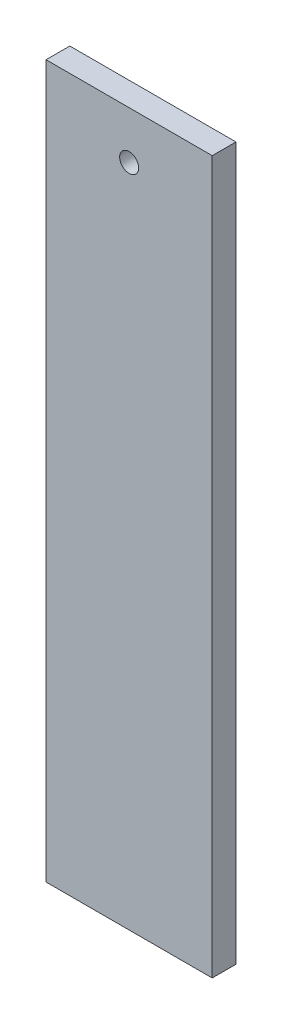
ISO-10303-21;
HEADER;
FILE_DESCRIPTION(('STEP AP214'),'2;1');
FILE_NAME('part.step','',(''),(''),'','','');
FILE_SCHEMA(('AUTOMOTIVE_DESIGN { 1 0 10303 214 1 1 1 1 }'));
ENDSEC;
DATA;
#1=APPLICATION_CONTEXT('core data for automotive mechanical design processes');
#2=APPLICATION_PROTOCOL_DEFINITION('international standard','automotive_design',2000,#1);
#3=PRODUCT_CONTEXT('',#1,'mechanical');
#4=PRODUCT('Part','Part','',(#3));
#5=PRODUCT_RELATED_PRODUCT_CATEGORY('part','',(#4));
#6=PRODUCT_DEFINITION_FORMATION('','',#4);
#7=PRODUCT_DEFINITION_CONTEXT('part definition',#1,'design');
#8=PRODUCT_DEFINITION('design','',#6,#7);
#9=PRODUCT_DEFINITION_SHAPE('','',#8);
#10=(LENGTH_UNIT() NAMED_UNIT(*) SI_UNIT(.MILLI.,.METRE.));
#11=(NAMED_UNIT(*) PLANE_ANGLE_UNIT() SI_UNIT($,.RADIAN.));
#12=(NAMED_UNIT(*) SI_UNIT($,.STERADIAN.) SOLID_ANGLE_UNIT());
#13=UNCERTAINTY_MEASURE_WITH_UNIT(LENGTH_MEASURE(1.E-05),#10,'distance_accuracy_value','');
#14=(GEOMETRIC_REPRESENTATION_CONTEXT(3) GLOBAL_UNCERTAINTY_ASSIGNED_CONTEXT((#13)) GLOBAL_UNIT_ASSIGNED_CONTEXT((#10,
#11,#12)) REPRESENTATION_CONTEXT('',''));
#15=CARTESIAN_POINT('',(0.,0.,0.));
#16=DIRECTION('',(0.,0.,1.));
#17=DIRECTION('',(1.,0.,0.));
#18=AXIS2_PLACEMENT_3D('',#15,#16,#17);
#19=CARTESIAN_POINT('',(0.,0.,5.));
#20=DIRECTION('',(1.,0.,0.));
#21=DIRECTION('',(0.,0.,-1.));
#22=AXIS2_PLACEMENT_3D('',#19,#20,#21);
#23=PLANE('',#22);
#24=DIRECTION('',(0.,-1.,0.));
#25=VECTOR('',#24,1.);
#26=CARTESIAN_POINT('',(0.,0.,0.));
#27=LINE('',#26,#25);
#28=CARTESIAN_POINT('',(0.,150.,0.));
#29=VERTEX_POINT('',#28);
#30=CARTESIAN_POINT('',(0.,0.,0.));
#31=VERTEX_POINT('',#30);
#32=EDGE_CURVE('E99',#29,#31,#27,.T.);
#33=ORIENTED_EDGE('',*,*,#32,.T.);
#34=DIRECTION('',(0.,0.,-1.));
#35=VECTOR('',#34,1.);
#36=CARTESIAN_POINT('',(0.,0.,5.));
#37=LINE('',#36,#35);
#38=CARTESIAN_POINT('',(0.,0.,5.));
#39=VERTEX_POINT('',#38);
#40=EDGE_CURVE('E11',#39,#31,#37,.T.);
#41=ORIENTED_EDGE('',*,*,#40,.F.);
#42=DIRECTION('',(0.,-1.,0.));
#43=VECTOR('',#42,1.);
#44=CARTESIAN_POINT('',(0.,0.,5.));
#45=LINE('',#44,#43);
#46=CARTESIAN_POINT('',(0.,150.,5.));
#47=VERTEX_POINT('',#46);
#48=EDGE_CURVE('E87',#47,#39,#45,.T.);
#49=ORIENTED_EDGE('',*,*,#48,.F.);
#50=DIRECTION('',(0.,0.,-1.));
#51=VECTOR('',#50,1.);
#52=CARTESIAN_POINT('',(0.,150.,5.));
#53=LINE('',#52,#51);
#54=EDGE_CURVE('E95',#47,#29,#53,.T.);
#55=ORIENTED_EDGE('',*,*,#54,.T.);
#56=EDGE_LOOP('',(#33,#41,#49,#55));
#57=FACE_BOUND('',#56,.T.);
#58=ADVANCED_FACE('F36',(#57),#23,.F.);
#59=CARTESIAN_POINT('',(0.,0.,5.));
#60=DIRECTION('',(0.,1.,0.));
#61=DIRECTION('',(0.,0.,1.));
#62=AXIS2_PLACEMENT_3D('',#59,#60,#61);
#63=PLANE('',#62);
#64=DIRECTION('',(1.,0.,0.));
#65=VECTOR('',#64,1.);
#66=CARTESIAN_POINT('',(0.,0.,0.));
#67=LINE('',#66,#65);
#68=CARTESIAN_POINT('',(35.,0.,0.));
#69=VERTEX_POINT('',#68);
#70=EDGE_CURVE('E91',#31,#69,#67,.T.);
#71=ORIENTED_EDGE('',*,*,#70,.T.);
#72=DIRECTION('',(0.,0.,-1.));
#73=VECTOR('',#72,1.);
#74=CARTESIAN_POINT('',(35.,0.,5.));
#75=LINE('',#74,#73);
#76=CARTESIAN_POINT('',(35.,0.,5.));
#77=VERTEX_POINT('',#76);
#78=EDGE_CURVE('E44',#77,#69,#75,.T.);
#79=ORIENTED_EDGE('',*,*,#78,.F.);
#80=DIRECTION('',(1.,0.,0.));
#81=VECTOR('',#80,1.);
#82=CARTESIAN_POINT('',(0.,0.,5.));
#83=LINE('',#82,#81);
#84=EDGE_CURVE('E82',#39,#77,#83,.T.);
#85=ORIENTED_EDGE('',*,*,#84,.F.);
#86=ORIENTED_EDGE('',*,*,#40,.T.);
#87=EDGE_LOOP('',(#71,#79,#85,#86));
#88=FACE_BOUND('',#87,.T.);
#89=ADVANCED_FACE('F90',(#88),#63,.F.);
#90=CARTESIAN_POINT('',(35.,0.,5.));
#91=DIRECTION('',(-1.,0.,0.));
#92=DIRECTION('',(0.,0.,1.));
#93=AXIS2_PLACEMENT_3D('',#90,#91,#92);
#94=PLANE('',#93);
#95=DIRECTION('',(0.,1.,0.));
#96=VECTOR('',#95,1.);
#97=CARTESIAN_POINT('',(35.,0.,0.));
#98=LINE('',#97,#96);
#99=CARTESIAN_POINT('',(35.,150.,0.));
#100=VERTEX_POINT('',#99);
#101=EDGE_CURVE('E69',#69,#100,#98,.T.);
#102=ORIENTED_EDGE('',*,*,#101,.T.);
#103=DIRECTION('',(0.,0.,-1.));
#104=VECTOR('',#103,1.);
#105=CARTESIAN_POINT('',(35.,150.,5.));
#106=LINE('',#105,#104);
#107=CARTESIAN_POINT('',(35.,150.,5.));
#108=VERTEX_POINT('',#107);
#109=EDGE_CURVE('E92',#108,#100,#106,.T.);
#110=ORIENTED_EDGE('',*,*,#109,.F.);
#111=DIRECTION('',(0.,1.,0.));
#112=VECTOR('',#111,1.);
#113=CARTESIAN_POINT('',(35.,0.,5.));
#114=LINE('',#113,#112);
#115=EDGE_CURVE('E85',#77,#108,#114,.T.);
#116=ORIENTED_EDGE('',*,*,#115,.F.);
#117=ORIENTED_EDGE('',*,*,#78,.T.);
#118=EDGE_LOOP('',(#102,#110,#116,#117));
#119=FACE_BOUND('',#118,.T.);
#120=ADVANCED_FACE('F93',(#119),#94,.F.);
#121=CARTESIAN_POINT('',(0.,150.,5.));
#122=DIRECTION('',(0.,-1.,0.));
#123=DIRECTION('',(0.,0.,-1.));
#124=AXIS2_PLACEMENT_3D('',#121,#122,#123);
#125=PLANE('',#124);
#126=DIRECTION('',(-1.,0.,0.));
#127=VECTOR('',#126,1.);
#128=CARTESIAN_POINT('',(0.,150.,0.));
#129=LINE('',#128,#127);
#130=EDGE_CURVE('E75',#100,#29,#129,.T.);
#131=ORIENTED_EDGE('',*,*,#130,.T.);
#132=ORIENTED_EDGE('',*,*,#54,.F.);
#133=DIRECTION('',(-1.,0.,0.));
#134=VECTOR('',#133,1.);
#135=CARTESIAN_POINT('',(0.,150.,5.));
#136=LINE('',#135,#134);
#137=EDGE_CURVE('E52',#108,#47,#136,.T.);
#138=ORIENTED_EDGE('',*,*,#137,.F.);
#139=ORIENTED_EDGE('',*,*,#109,.T.);
#140=EDGE_LOOP('',(#131,#132,#138,#139));
#141=FACE_BOUND('',#140,.T.);
#142=ADVANCED_FACE('F107',(#141),#125,.F.);
#143=CARTESIAN_POINT('',(0.,0.,5.));
#144=DIRECTION('',(0.,0.,-1.));
#145=DIRECTION('',(-1.,0.,0.));
#146=AXIS2_PLACEMENT_3D('',#143,#144,#145);
#147=PLANE('',#146);
#148=CARTESIAN_POINT('',(17.5,140.,5.));
#149=DIRECTION('',(0.,0.,1.));
#150=DIRECTION('',(1.,0.,0.));
#151=AXIS2_PLACEMENT_3D('',#148,#149,#150);
#152=CIRCLE('',#151,2.);
#153=CARTESIAN_POINT('',(19.5,140.,5.));
#154=VERTEX_POINT('',#153);
#155=EDGE_CURVE('E113',#154,#154,#152,.T.);
#156=ORIENTED_EDGE('',*,*,#155,.F.);
#157=EDGE_LOOP('',(#156));
#158=FACE_BOUND('',#157,.T.);
#159=ORIENTED_EDGE('',*,*,#48,.T.);
#160=ORIENTED_EDGE('',*,*,#84,.T.);
#161=ORIENTED_EDGE('',*,*,#115,.T.);
#162=ORIENTED_EDGE('',*,*,#137,.T.);
#163=EDGE_LOOP('',(#159,#160,#161,#162));
#164=FACE_BOUND('',#163,.T.);
#165=ADVANCED_FACE('F83',(#158,#164),#147,.F.);
#166=CARTESIAN_POINT('',(0.,0.,0.));
#167=DIRECTION('',(0.,0.,-1.));
#168=DIRECTION('',(-1.,0.,0.));
#169=AXIS2_PLACEMENT_3D('',#166,#167,#168);
#170=PLANE('',#169);
#171=CARTESIAN_POINT('',(17.5,140.,0.));
#172=DIRECTION('',(0.,0.,1.));
#173=DIRECTION('',(1.,0.,0.));
#174=AXIS2_PLACEMENT_3D('',#171,#172,#173);
#175=CIRCLE('',#174,2.);
#176=CARTESIAN_POINT('',(19.5,140.,0.));
#177=VERTEX_POINT('',#176);
#178=EDGE_CURVE('E102',#177,#177,#175,.T.);
#179=ORIENTED_EDGE('',*,*,#178,.T.);
#180=EDGE_LOOP('',(#179));
#181=FACE_BOUND('',#180,.T.);
#182=ORIENTED_EDGE('',*,*,#32,.F.);
#183=ORIENTED_EDGE('',*,*,#130,.F.);
#184=ORIENTED_EDGE('',*,*,#101,.F.);
#185=ORIENTED_EDGE('',*,*,#70,.F.);
#186=EDGE_LOOP('',(#182,#183,#184,#185));
#187=FACE_BOUND('',#186,.T.);
#188=ADVANCED_FACE('F110',(#181,#187),#170,.T.);
#189=CARTESIAN_POINT('',(17.5,140.,0.));
#190=DIRECTION('',(0.,0.,1.));
#191=DIRECTION('',(1.,0.,0.));
#192=AXIS2_PLACEMENT_3D('',#189,#190,#191);
#193=CYLINDRICAL_SURFACE('',#192,2.);
#194=ORIENTED_EDGE('',*,*,#178,.F.);
#195=EDGE_LOOP('',(#194));
#196=FACE_BOUND('',#195,.T.);
#197=ORIENTED_EDGE('',*,*,#155,.T.);
#198=EDGE_LOOP('',(#197));
#199=FACE_BOUND('',#198,.T.);
#200=ADVANCED_FACE('F120',(#196,#199),#193,.F.);
#201=CLOSED_SHELL('',(#58,#89,#120,#142,#165,#188,#200));
#202=MANIFOLD_SOLID_BREP('B2',#201);
#203=ADVANCED_BREP_SHAPE_REPRESENTATION('',(#18,#202),#14);
#204=SHAPE_DEFINITION_REPRESENTATION(#9,#203);
ENDSEC;
END-ISO-10303-21;
